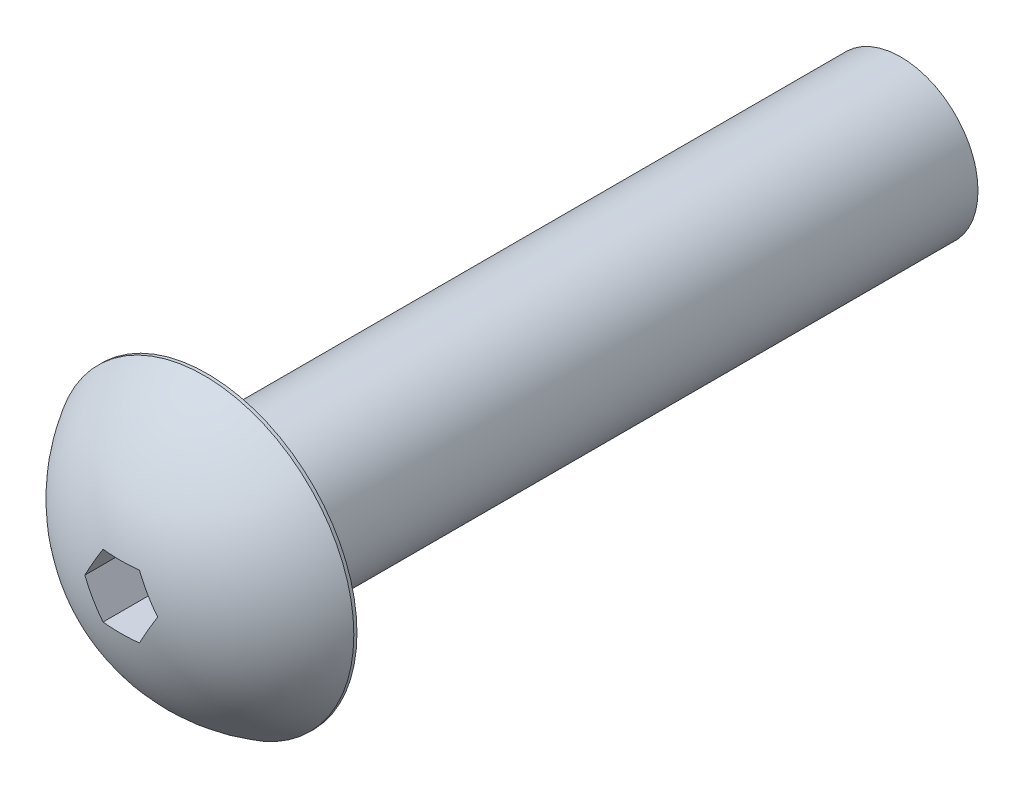
ISO-10303-21;
HEADER;
FILE_DESCRIPTION(('STEP AP214'),'2;1');
FILE_NAME('part.step','',(''),(''),'','','');
FILE_SCHEMA(('AUTOMOTIVE_DESIGN { 1 0 10303 214 1 1 1 1 }'));
ENDSEC;
DATA;
#1=APPLICATION_CONTEXT('core data for automotive mechanical design processes');
#2=APPLICATION_PROTOCOL_DEFINITION('international standard','automotive_design',2000,#1);
#3=PRODUCT_CONTEXT('',#1,'mechanical');
#4=PRODUCT('Part','Part','',(#3));
#5=PRODUCT_RELATED_PRODUCT_CATEGORY('part','',(#4));
#6=PRODUCT_DEFINITION_FORMATION('','',#4);
#7=PRODUCT_DEFINITION_CONTEXT('part definition',#1,'design');
#8=PRODUCT_DEFINITION('design','',#6,#7);
#9=PRODUCT_DEFINITION_SHAPE('','',#8);
#10=(LENGTH_UNIT() NAMED_UNIT(*) SI_UNIT(.MILLI.,.METRE.));
#11=(NAMED_UNIT(*) PLANE_ANGLE_UNIT() SI_UNIT($,.RADIAN.));
#12=(NAMED_UNIT(*) SI_UNIT($,.STERADIAN.) SOLID_ANGLE_UNIT());
#13=UNCERTAINTY_MEASURE_WITH_UNIT(LENGTH_MEASURE(1.E-05),#10,'distance_accuracy_value','');
#14=(GEOMETRIC_REPRESENTATION_CONTEXT(3) GLOBAL_UNCERTAINTY_ASSIGNED_CONTEXT((#13)) GLOBAL_UNIT_ASSIGNED_CONTEXT((#10,
#11,#12)) REPRESENTATION_CONTEXT('',''));
#15=CARTESIAN_POINT('',(0.,0.,0.));
#16=DIRECTION('',(0.,0.,1.));
#17=DIRECTION('',(1.,0.,0.));
#18=AXIS2_PLACEMENT_3D('',#15,#16,#17);
#19=CARTESIAN_POINT('',(0.,0.,22.));
#20=DIRECTION('',(0.,0.,-1.));
#21=DIRECTION('',(-1.,0.,0.));
#22=AXIS2_PLACEMENT_3D('',#19,#20,#21);
#23=CYLINDRICAL_SURFACE('',#22,2.45);
#24=CARTESIAN_POINT('',(0.,0.,22.));
#25=DIRECTION('',(0.,0.,1.));
#26=DIRECTION('',(1.,0.,0.));
#27=AXIS2_PLACEMENT_3D('',#24,#25,#26);
#28=CIRCLE('',#27,2.45);
#29=CARTESIAN_POINT('',(2.45,0.,22.));
#30=VERTEX_POINT('',#29);
#31=EDGE_CURVE('E127',#30,#30,#28,.T.);
#32=ORIENTED_EDGE('',*,*,#31,.F.);
#33=EDGE_LOOP('',(#32));
#34=FACE_BOUND('',#33,.T.);
#35=CARTESIAN_POINT('',(0.,0.,0.));
#36=DIRECTION('',(0.,0.,1.));
#37=DIRECTION('',(1.,0.,0.));
#38=AXIS2_PLACEMENT_3D('',#35,#36,#37);
#39=CIRCLE('',#38,2.45);
#40=CARTESIAN_POINT('',(2.45,0.,0.));
#41=VERTEX_POINT('',#40);
#42=EDGE_CURVE('E130',#41,#41,#39,.T.);
#43=ORIENTED_EDGE('',*,*,#42,.T.);
#44=EDGE_LOOP('',(#43));
#45=FACE_BOUND('',#44,.T.);
#46=ADVANCED_FACE('F34',(#34,#45),#23,.T.);
#47=CARTESIAN_POINT('',(0.,0.,0.));
#48=DIRECTION('',(0.,0.,1.));
#49=DIRECTION('',(1.,0.,0.));
#50=AXIS2_PLACEMENT_3D('',#47,#48,#49);
#51=PLANE('',#50);
#52=ORIENTED_EDGE('',*,*,#42,.F.);
#53=EDGE_LOOP('',(#52));
#54=FACE_BOUND('',#53,.T.);
#55=ADVANCED_FACE('F168',(#54),#51,.F.);
#56=CARTESIAN_POINT('',(0.,0.,22.));
#57=DIRECTION('',(0.,0.,1.));
#58=DIRECTION('',(1.,0.,0.));
#59=AXIS2_PLACEMENT_3D('',#56,#57,#58);
#60=PLANE('',#59);
#61=CARTESIAN_POINT('',(0.,0.,22.));
#62=DIRECTION('',(0.,0.,1.));
#63=DIRECTION('',(1.,0.,0.));
#64=AXIS2_PLACEMENT_3D('',#61,#62,#63);
#65=CIRCLE('',#64,4.75);
#66=CARTESIAN_POINT('',(4.75,0.,22.));
#67=VERTEX_POINT('',#66);
#68=EDGE_CURVE('E116',#67,#67,#65,.T.);
#69=ORIENTED_EDGE('',*,*,#68,.F.);
#70=EDGE_LOOP('',(#69));
#71=FACE_BOUND('',#70,.T.);
#72=ORIENTED_EDGE('',*,*,#31,.T.);
#73=EDGE_LOOP('',(#72));
#74=FACE_BOUND('',#73,.T.);
#75=ADVANCED_FACE('F173',(#71,#74),#60,.F.);
#76=CARTESIAN_POINT('',(0.,0.,22.1));
#77=DIRECTION('',(0.,0.,-1.));
#78=DIRECTION('',(-1.,0.,0.));
#79=AXIS2_PLACEMENT_3D('',#76,#77,#78);
#80=CYLINDRICAL_SURFACE('',#79,4.75);
#81=CARTESIAN_POINT('',(0.,0.,22.1));
#82=DIRECTION('',(0.,0.,1.));
#83=DIRECTION('',(1.,0.,0.));
#84=AXIS2_PLACEMENT_3D('',#81,#82,#83);
#85=CIRCLE('',#84,4.75);
#86=CARTESIAN_POINT('',(4.75,0.,22.1));
#87=VERTEX_POINT('',#86);
#88=EDGE_CURVE('E126',#87,#87,#85,.T.);
#89=ORIENTED_EDGE('',*,*,#88,.F.);
#90=EDGE_LOOP('',(#89));
#91=FACE_BOUND('',#90,.T.);
#92=ORIENTED_EDGE('',*,*,#68,.T.);
#93=EDGE_LOOP('',(#92));
#94=FACE_BOUND('',#93,.T.);
#95=ADVANCED_FACE('F179',(#91,#94),#80,.T.);
#96=CARTESIAN_POINT('',(0.,0.,19.3727272727273));
#97=DIRECTION('',(0.,0.,1.));
#98=DIRECTION('',(1.,0.,0.));
#99=AXIS2_PLACEMENT_3D('',#96,#97,#98);
#100=SPHERICAL_SURFACE('',#99,5.47727272727273);
#101=CARTESIAN_POINT('',(0.,1.,19.3727272727273));
#102=DIRECTION('',(0.,1.,0.));
#103=DIRECTION('',(-1.,0.,0.));
#104=AXIS2_PLACEMENT_3D('',#101,#102,#103);
#105=CIRCLE('',#104,5.38521276542772);
#106=CARTESIAN_POINT('',(0.577350269189626,1.,24.7269016437757));
#107=VERTEX_POINT('',#106);
#108=CARTESIAN_POINT('',(-0.577350269189626,1.,24.7269016437757));
#109=VERTEX_POINT('',#108);
#110=EDGE_CURVE('E11',#107,#109,#105,.F.);
#111=ORIENTED_EDGE('',*,*,#110,.F.);
#112=CARTESIAN_POINT('',(0.866025403784438,0.5,19.3727272727273));
#113=DIRECTION('',(0.866025403784438,0.5,0.));
#114=DIRECTION('',(-0.5,0.866025403784439,0.));
#115=AXIS2_PLACEMENT_3D('',#112,#113,#114);
#116=CIRCLE('',#115,5.38521276542772);
#117=CARTESIAN_POINT('',(1.15470053837925,0.,24.7269016437757));
#118=VERTEX_POINT('',#117);
#119=EDGE_CURVE('E88',#118,#107,#116,.F.);
#120=ORIENTED_EDGE('',*,*,#119,.F.);
#121=CARTESIAN_POINT('',(0.866025403784439,-0.5,19.3727272727273));
#122=DIRECTION('',(0.866025403784439,-0.5,0.));
#123=DIRECTION('',(0.5,0.866025403784439,0.));
#124=AXIS2_PLACEMENT_3D('',#121,#122,#123);
#125=CIRCLE('',#124,5.38521276542772);
#126=CARTESIAN_POINT('',(0.577350269189626,-1.,24.7269016437757));
#127=VERTEX_POINT('',#126);
#128=EDGE_CURVE('E136',#127,#118,#125,.F.);
#129=ORIENTED_EDGE('',*,*,#128,.F.);
#130=CARTESIAN_POINT('',(0.,-1.,19.3727272727273));
#131=DIRECTION('',(0.,-1.,0.));
#132=DIRECTION('',(0.,0.,-1.));
#133=AXIS2_PLACEMENT_3D('',#130,#131,#132);
#134=CIRCLE('',#133,5.38521276542772);
#135=CARTESIAN_POINT('',(-0.577350269189626,-1.,24.7269016437757));
#136=VERTEX_POINT('',#135);
#137=EDGE_CURVE('E138',#136,#127,#134,.F.);
#138=ORIENTED_EDGE('',*,*,#137,.F.);
#139=CARTESIAN_POINT('',(-0.866025403784438,-0.5,19.3727272727273));
#140=DIRECTION('',(-0.866025403784438,-0.5,0.));
#141=DIRECTION('',(0.5,-0.866025403784439,0.));
#142=AXIS2_PLACEMENT_3D('',#139,#140,#141);
#143=CIRCLE('',#142,5.38521276542772);
#144=CARTESIAN_POINT('',(-1.15470053837925,0.,24.7269016437757));
#145=VERTEX_POINT('',#144);
#146=EDGE_CURVE('E140',#145,#136,#143,.F.);
#147=ORIENTED_EDGE('',*,*,#146,.F.);
#148=CARTESIAN_POINT('',(-0.866025403784439,0.5,19.3727272727273));
#149=DIRECTION('',(-0.866025403784439,0.5,0.));
#150=DIRECTION('',(-0.5,-0.866025403784439,0.));
#151=AXIS2_PLACEMENT_3D('',#148,#149,#150);
#152=CIRCLE('',#151,5.38521276542772);
#153=EDGE_CURVE('E42',#109,#145,#152,.F.);
#154=ORIENTED_EDGE('',*,*,#153,.F.);
#155=EDGE_LOOP('',(#111,#120,#129,#138,#147,#154));
#156=FACE_BOUND('',#155,.T.);
#157=ORIENTED_EDGE('',*,*,#88,.T.);
#158=EDGE_LOOP('',(#157));
#159=FACE_BOUND('',#158,.T.);
#160=ADVANCED_FACE('F36',(#156,#159),#100,.T.);
#161=CARTESIAN_POINT('',(-0.577350269189626,1.,24.85));
#162=DIRECTION('',(0.,1.,0.));
#163=DIRECTION('',(-1.,0.,0.));
#164=AXIS2_PLACEMENT_3D('',#161,#162,#163);
#165=PLANE('',#164);
#166=ORIENTED_EDGE('',*,*,#110,.T.);
#167=DIRECTION('',(0.,0.,-1.));
#168=VECTOR('',#167,1.);
#169=CARTESIAN_POINT('',(-0.577350269189626,1.,24.85));
#170=LINE('',#169,#168);
#171=CARTESIAN_POINT('',(-0.577350269189626,1.,22.));
#172=VERTEX_POINT('',#171);
#173=EDGE_CURVE('E104',#109,#172,#170,.T.);
#174=ORIENTED_EDGE('',*,*,#173,.T.);
#175=DIRECTION('',(1.,0.,0.));
#176=VECTOR('',#175,1.);
#177=CARTESIAN_POINT('',(-0.577350269189626,1.,22.));
#178=LINE('',#177,#176);
#179=CARTESIAN_POINT('',(0.577350269189626,1.,22.));
#180=VERTEX_POINT('',#179);
#181=EDGE_CURVE('E97',#172,#180,#178,.T.);
#182=ORIENTED_EDGE('',*,*,#181,.T.);
#183=DIRECTION('',(0.,0.,-1.));
#184=VECTOR('',#183,1.);
#185=CARTESIAN_POINT('',(0.577350269189626,1.,24.85));
#186=LINE('',#185,#184);
#187=EDGE_CURVE('E83',#107,#180,#186,.T.);
#188=ORIENTED_EDGE('',*,*,#187,.F.);
#189=EDGE_LOOP('',(#166,#174,#182,#188));
#190=FACE_BOUND('',#189,.T.);
#191=ADVANCED_FACE('F103',(#190),#165,.F.);
#192=CARTESIAN_POINT('',(-1.15470053837925,0.,24.85));
#193=DIRECTION('',(-0.866025403784439,0.5,0.));
#194=DIRECTION('',(-0.5,-0.866025403784439,0.));
#195=AXIS2_PLACEMENT_3D('',#192,#193,#194);
#196=PLANE('',#195);
#197=ORIENTED_EDGE('',*,*,#153,.T.);
#198=DIRECTION('',(0.,0.,-1.));
#199=VECTOR('',#198,1.);
#200=CARTESIAN_POINT('',(-1.15470053837925,0.,24.85));
#201=LINE('',#200,#199);
#202=CARTESIAN_POINT('',(-1.15470053837925,0.,22.));
#203=VERTEX_POINT('',#202);
#204=EDGE_CURVE('E117',#145,#203,#201,.T.);
#205=ORIENTED_EDGE('',*,*,#204,.T.);
#206=DIRECTION('',(0.5,0.866025403784439,0.));
#207=VECTOR('',#206,1.);
#208=CARTESIAN_POINT('',(-1.15470053837925,0.,22.));
#209=LINE('',#208,#207);
#210=EDGE_CURVE('E90',#203,#172,#209,.T.);
#211=ORIENTED_EDGE('',*,*,#210,.T.);
#212=ORIENTED_EDGE('',*,*,#173,.F.);
#213=EDGE_LOOP('',(#197,#205,#211,#212));
#214=FACE_BOUND('',#213,.T.);
#215=ADVANCED_FACE('F144',(#214),#196,.F.);
#216=CARTESIAN_POINT('',(-0.577350269189626,-1.,24.85));
#217=DIRECTION('',(-0.866025403784438,-0.5,0.));
#218=DIRECTION('',(0.5,-0.866025403784439,0.));
#219=AXIS2_PLACEMENT_3D('',#216,#217,#218);
#220=PLANE('',#219);
#221=ORIENTED_EDGE('',*,*,#146,.T.);
#222=DIRECTION('',(0.,0.,-1.));
#223=VECTOR('',#222,1.);
#224=CARTESIAN_POINT('',(-0.577350269189626,-1.,24.85));
#225=LINE('',#224,#223);
#226=CARTESIAN_POINT('',(-0.577350269189626,-1.,22.));
#227=VERTEX_POINT('',#226);
#228=EDGE_CURVE('E119',#136,#227,#225,.T.);
#229=ORIENTED_EDGE('',*,*,#228,.T.);
#230=DIRECTION('',(-0.5,0.866025403784439,0.));
#231=VECTOR('',#230,1.);
#232=CARTESIAN_POINT('',(-0.577350269189626,-1.,22.));
#233=LINE('',#232,#231);
#234=EDGE_CURVE('E111',#227,#203,#233,.T.);
#235=ORIENTED_EDGE('',*,*,#234,.T.);
#236=ORIENTED_EDGE('',*,*,#204,.F.);
#237=EDGE_LOOP('',(#221,#229,#235,#236));
#238=FACE_BOUND('',#237,.T.);
#239=ADVANCED_FACE('F148',(#238),#220,.F.);
#240=CARTESIAN_POINT('',(0.577350269189626,-1.,24.85));
#241=DIRECTION('',(0.,-1.,0.));
#242=DIRECTION('',(0.,0.,-1.));
#243=AXIS2_PLACEMENT_3D('',#240,#241,#242);
#244=PLANE('',#243);
#245=ORIENTED_EDGE('',*,*,#137,.T.);
#246=DIRECTION('',(0.,0.,-1.));
#247=VECTOR('',#246,1.);
#248=CARTESIAN_POINT('',(0.577350269189626,-1.,24.85));
#249=LINE('',#248,#247);
#250=CARTESIAN_POINT('',(0.577350269189626,-1.,22.));
#251=VERTEX_POINT('',#250);
#252=EDGE_CURVE('E121',#127,#251,#249,.T.);
#253=ORIENTED_EDGE('',*,*,#252,.T.);
#254=DIRECTION('',(-1.,0.,0.));
#255=VECTOR('',#254,1.);
#256=CARTESIAN_POINT('',(0.577350269189626,-1.,22.));
#257=LINE('',#256,#255);
#258=EDGE_CURVE('E108',#251,#227,#257,.T.);
#259=ORIENTED_EDGE('',*,*,#258,.T.);
#260=ORIENTED_EDGE('',*,*,#228,.F.);
#261=EDGE_LOOP('',(#245,#253,#259,#260));
#262=FACE_BOUND('',#261,.T.);
#263=ADVANCED_FACE('F156',(#262),#244,.F.);
#264=CARTESIAN_POINT('',(1.15470053837925,0.,24.85));
#265=DIRECTION('',(0.866025403784439,-0.5,0.));
#266=DIRECTION('',(0.5,0.866025403784439,0.));
#267=AXIS2_PLACEMENT_3D('',#264,#265,#266);
#268=PLANE('',#267);
#269=ORIENTED_EDGE('',*,*,#128,.T.);
#270=DIRECTION('',(0.,0.,-1.));
#271=VECTOR('',#270,1.);
#272=CARTESIAN_POINT('',(1.15470053837925,0.,24.85));
#273=LINE('',#272,#271);
#274=CARTESIAN_POINT('',(1.15470053837925,0.,22.));
#275=VERTEX_POINT('',#274);
#276=EDGE_CURVE('E49',#118,#275,#273,.T.);
#277=ORIENTED_EDGE('',*,*,#276,.T.);
#278=DIRECTION('',(-0.5,-0.866025403784439,0.));
#279=VECTOR('',#278,1.);
#280=CARTESIAN_POINT('',(1.15470053837925,0.,22.));
#281=LINE('',#280,#279);
#282=EDGE_CURVE('E101',#275,#251,#281,.T.);
#283=ORIENTED_EDGE('',*,*,#282,.T.);
#284=ORIENTED_EDGE('',*,*,#252,.F.);
#285=EDGE_LOOP('',(#269,#277,#283,#284));
#286=FACE_BOUND('',#285,.T.);
#287=ADVANCED_FACE('F158',(#286),#268,.F.);
#288=CARTESIAN_POINT('',(0.577350269189626,1.,24.85));
#289=DIRECTION('',(0.866025403784438,0.5,0.));
#290=DIRECTION('',(-0.5,0.866025403784439,0.));
#291=AXIS2_PLACEMENT_3D('',#288,#289,#290);
#292=PLANE('',#291);
#293=ORIENTED_EDGE('',*,*,#119,.T.);
#294=ORIENTED_EDGE('',*,*,#187,.T.);
#295=DIRECTION('',(0.5,-0.866025403784438,0.));
#296=VECTOR('',#295,1.);
#297=CARTESIAN_POINT('',(0.577350269189626,1.,22.));
#298=LINE('',#297,#296);
#299=EDGE_CURVE('E86',#180,#275,#298,.T.);
#300=ORIENTED_EDGE('',*,*,#299,.T.);
#301=ORIENTED_EDGE('',*,*,#276,.F.);
#302=EDGE_LOOP('',(#293,#294,#300,#301));
#303=FACE_BOUND('',#302,.T.);
#304=ADVANCED_FACE('F85',(#303),#292,.F.);
#305=CARTESIAN_POINT('',(0.577350269189626,1.,22.));
#306=DIRECTION('',(0.,0.,-1.));
#307=DIRECTION('',(-1.,0.,0.));
#308=AXIS2_PLACEMENT_3D('',#305,#306,#307);
#309=PLANE('',#308);
#310=ORIENTED_EDGE('',*,*,#181,.F.);
#311=ORIENTED_EDGE('',*,*,#210,.F.);
#312=ORIENTED_EDGE('',*,*,#234,.F.);
#313=ORIENTED_EDGE('',*,*,#258,.F.);
#314=ORIENTED_EDGE('',*,*,#282,.F.);
#315=ORIENTED_EDGE('',*,*,#299,.F.);
#316=EDGE_LOOP('',(#310,#311,#312,#313,#314,#315));
#317=FACE_BOUND('',#316,.T.);
#318=ADVANCED_FACE('F95',(#317),#309,.F.);
#319=CLOSED_SHELL('',(#46,#55,#75,#95,#160,#191,#215,#239,#263,#287,#304,#318));
#320=MANIFOLD_SOLID_BREP('B2',#319);
#321=ADVANCED_BREP_SHAPE_REPRESENTATION('',(#18,#320),#14);
#322=SHAPE_DEFINITION_REPRESENTATION(#9,#321);
ENDSEC;
END-ISO-10303-21;
